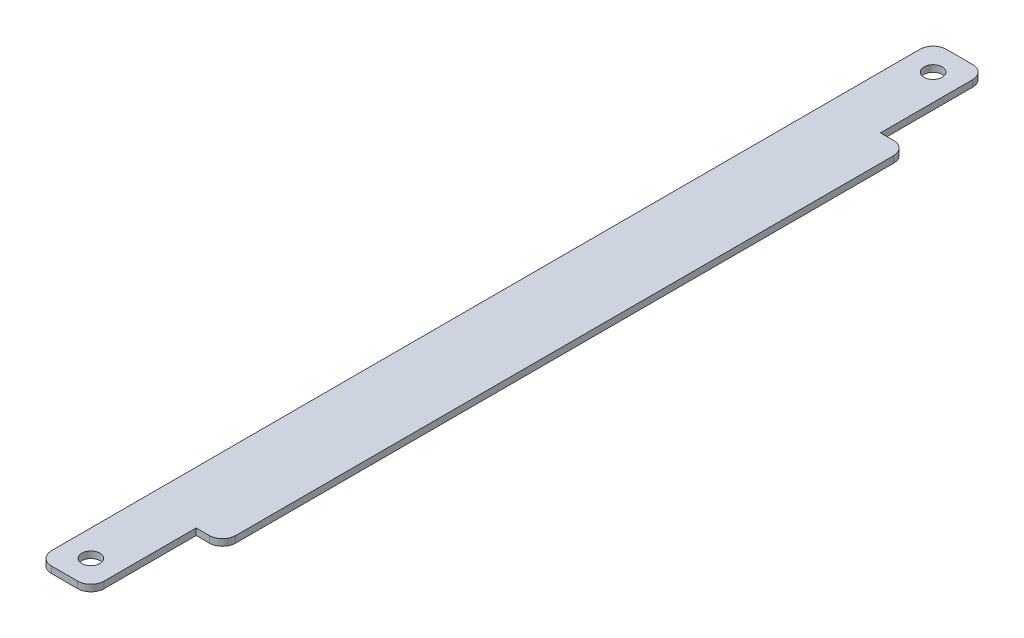
ISO-10303-21;
HEADER;
FILE_DESCRIPTION(('STEP AP214'),'2;1');
FILE_NAME('part.step','',(''),(''),'','','');
FILE_SCHEMA(('AUTOMOTIVE_DESIGN { 1 0 10303 214 1 1 1 1 }'));
ENDSEC;
DATA;
#1=APPLICATION_CONTEXT('core data for automotive mechanical design processes');
#2=APPLICATION_PROTOCOL_DEFINITION('international standard','automotive_design',2000,#1);
#3=PRODUCT_CONTEXT('',#1,'mechanical');
#4=PRODUCT('Part','Part','',(#3));
#5=PRODUCT_RELATED_PRODUCT_CATEGORY('part','',(#4));
#6=PRODUCT_DEFINITION_FORMATION('','',#4);
#7=PRODUCT_DEFINITION_CONTEXT('part definition',#1,'design');
#8=PRODUCT_DEFINITION('design','',#6,#7);
#9=PRODUCT_DEFINITION_SHAPE('','',#8);
#10=(LENGTH_UNIT() NAMED_UNIT(*) SI_UNIT(.MILLI.,.METRE.));
#11=(NAMED_UNIT(*) PLANE_ANGLE_UNIT() SI_UNIT($,.RADIAN.));
#12=(NAMED_UNIT(*) SI_UNIT($,.STERADIAN.) SOLID_ANGLE_UNIT());
#13=UNCERTAINTY_MEASURE_WITH_UNIT(LENGTH_MEASURE(1.E-05),#10,'distance_accuracy_value','');
#14=(GEOMETRIC_REPRESENTATION_CONTEXT(3) GLOBAL_UNCERTAINTY_ASSIGNED_CONTEXT((#13)) GLOBAL_UNIT_ASSIGNED_CONTEXT((#10,
#11,#12)) REPRESENTATION_CONTEXT('',''));
#15=CARTESIAN_POINT('',(0.,0.,0.));
#16=DIRECTION('',(0.,0.,1.));
#17=DIRECTION('',(1.,0.,0.));
#18=AXIS2_PLACEMENT_3D('',#15,#16,#17);
#19=CARTESIAN_POINT('',(15.875,1.5875,-187.325));
#20=DIRECTION('',(0.,1.,0.));
#21=DIRECTION('',(0.,0.,1.));
#22=AXIS2_PLACEMENT_3D('',#19,#20,#21);
#23=PLANE('',#22);
#24=CARTESIAN_POINT('',(6.35,1.5875,-209.55));
#25=DIRECTION('',(0.,1.,0.));
#26=DIRECTION('',(0.,0.,1.));
#27=AXIS2_PLACEMENT_3D('',#24,#25,#26);
#28=CIRCLE('',#27,2.1828125);
#29=CARTESIAN_POINT('',(6.35,1.5875,-207.3671875));
#30=VERTEX_POINT('',#29);
#31=EDGE_CURVE('E174',#30,#30,#28,.T.);
#32=ORIENTED_EDGE('',*,*,#31,.F.);
#33=EDGE_LOOP('',(#32));
#34=FACE_BOUND('',#33,.T.);
#35=DIRECTION('',(-1.,0.,0.));
#36=VECTOR('',#35,1.);
#37=CARTESIAN_POINT('',(12.7,1.5875,-190.5));
#38=LINE('',#37,#36);
#39=CARTESIAN_POINT('',(15.875,1.5875,-190.5));
#40=VERTEX_POINT('',#39);
#41=CARTESIAN_POINT('',(12.7,1.5875,-190.5));
#42=VERTEX_POINT('',#41);
#43=EDGE_CURVE('E197',#40,#42,#38,.T.);
#44=ORIENTED_EDGE('',*,*,#43,.T.);
#45=DIRECTION('',(0.,0.,-1.));
#46=VECTOR('',#45,1.);
#47=CARTESIAN_POINT('',(12.7,1.5875,-212.725));
#48=LINE('',#47,#46);
#49=CARTESIAN_POINT('',(12.7,1.5875,-212.725));
#50=VERTEX_POINT('',#49);
#51=EDGE_CURVE('E115',#42,#50,#48,.T.);
#52=ORIENTED_EDGE('',*,*,#51,.T.);
#53=CARTESIAN_POINT('',(9.525,1.5875,-212.725));
#54=DIRECTION('',(0.,1.,0.));
#55=DIRECTION('',(0.,0.,1.));
#56=AXIS2_PLACEMENT_3D('',#53,#54,#55);
#57=CIRCLE('',#56,3.17500000000001);
#58=CARTESIAN_POINT('',(9.52499999999997,1.5875,-215.9));
#59=VERTEX_POINT('',#58);
#60=EDGE_CURVE('E230',#50,#59,#57,.T.);
#61=ORIENTED_EDGE('',*,*,#60,.T.);
#62=DIRECTION('',(-1.,0.,0.));
#63=VECTOR('',#62,1.);
#64=CARTESIAN_POINT('',(3.17500000000002,1.5875,-215.9));
#65=LINE('',#64,#63);
#66=CARTESIAN_POINT('',(3.17500000000002,1.5875,-215.9));
#67=VERTEX_POINT('',#66);
#68=EDGE_CURVE('E249',#59,#67,#65,.T.);
#69=ORIENTED_EDGE('',*,*,#68,.T.);
#70=CARTESIAN_POINT('',(3.175,1.5875,-212.725));
#71=DIRECTION('',(0.,1.,0.));
#72=DIRECTION('',(0.,0.,1.));
#73=AXIS2_PLACEMENT_3D('',#70,#71,#72);
#74=CIRCLE('',#73,3.17500000000001);
#75=CARTESIAN_POINT('',(0.,1.5875,-212.725));
#76=VERTEX_POINT('',#75);
#77=EDGE_CURVE('E246',#67,#76,#74,.T.);
#78=ORIENTED_EDGE('',*,*,#77,.T.);
#79=DIRECTION('',(0.,0.,1.));
#80=VECTOR('',#79,1.);
#81=CARTESIAN_POINT('',(0.,1.5875,-3.17500000000002));
#82=LINE('',#81,#80);
#83=CARTESIAN_POINT('',(0.,1.5875,-3.17500000000002));
#84=VERTEX_POINT('',#83);
#85=EDGE_CURVE('E248',#76,#84,#82,.T.);
#86=ORIENTED_EDGE('',*,*,#85,.T.);
#87=CARTESIAN_POINT('',(3.175,1.5875,-3.175));
#88=DIRECTION('',(0.,1.,0.));
#89=DIRECTION('',(0.,0.,1.));
#90=AXIS2_PLACEMENT_3D('',#87,#88,#89);
#91=CIRCLE('',#90,3.175);
#92=CARTESIAN_POINT('',(3.175,1.5875,0.));
#93=VERTEX_POINT('',#92);
#94=EDGE_CURVE('E251',#84,#93,#91,.T.);
#95=ORIENTED_EDGE('',*,*,#94,.T.);
#96=DIRECTION('',(1.,0.,0.));
#97=VECTOR('',#96,1.);
#98=CARTESIAN_POINT('',(9.52499999999998,1.5875,0.));
#99=LINE('',#98,#97);
#100=CARTESIAN_POINT('',(9.52499999999998,1.5875,0.));
#101=VERTEX_POINT('',#100);
#102=EDGE_CURVE('E257',#93,#101,#99,.T.);
#103=ORIENTED_EDGE('',*,*,#102,.T.);
#104=CARTESIAN_POINT('',(9.525,1.5875,-3.175));
#105=DIRECTION('',(0.,1.,0.));
#106=DIRECTION('',(0.,0.,1.));
#107=AXIS2_PLACEMENT_3D('',#104,#105,#106);
#108=CIRCLE('',#107,3.175);
#109=CARTESIAN_POINT('',(12.7,1.5875,-3.17500000000002));
#110=VERTEX_POINT('',#109);
#111=EDGE_CURVE('E259',#101,#110,#108,.T.);
#112=ORIENTED_EDGE('',*,*,#111,.T.);
#113=DIRECTION('',(0.,0.,-1.));
#114=VECTOR('',#113,1.);
#115=CARTESIAN_POINT('',(12.7,1.5875,-25.4));
#116=LINE('',#115,#114);
#117=CARTESIAN_POINT('',(12.7,1.5875,-25.4));
#118=VERTEX_POINT('',#117);
#119=EDGE_CURVE('E261',#110,#118,#116,.T.);
#120=ORIENTED_EDGE('',*,*,#119,.T.);
#121=DIRECTION('',(1.,0.,0.));
#122=VECTOR('',#121,1.);
#123=CARTESIAN_POINT('',(15.875,1.5875,-25.4));
#124=LINE('',#123,#122);
#125=CARTESIAN_POINT('',(15.875,1.5875,-25.4));
#126=VERTEX_POINT('',#125);
#127=EDGE_CURVE('E152',#118,#126,#124,.T.);
#128=ORIENTED_EDGE('',*,*,#127,.T.);
#129=CARTESIAN_POINT('',(15.875,1.5875,-28.575));
#130=DIRECTION('',(0.,1.,0.));
#131=DIRECTION('',(0.,0.,1.));
#132=AXIS2_PLACEMENT_3D('',#129,#130,#131);
#133=CIRCLE('',#132,3.175);
#134=CARTESIAN_POINT('',(19.05,1.5875,-28.575));
#135=VERTEX_POINT('',#134);
#136=EDGE_CURVE('E146',#126,#135,#133,.T.);
#137=ORIENTED_EDGE('',*,*,#136,.T.);
#138=DIRECTION('',(0.,0.,-1.));
#139=VECTOR('',#138,1.);
#140=CARTESIAN_POINT('',(19.05,1.5875,-187.325));
#141=LINE('',#140,#139);
#142=CARTESIAN_POINT('',(19.05,1.5875,-187.325));
#143=VERTEX_POINT('',#142);
#144=EDGE_CURVE('E150',#135,#143,#141,.T.);
#145=ORIENTED_EDGE('',*,*,#144,.T.);
#146=CARTESIAN_POINT('',(15.875,1.5875,-187.325));
#147=DIRECTION('',(0.,1.,0.));
#148=DIRECTION('',(0.,0.,1.));
#149=AXIS2_PLACEMENT_3D('',#146,#147,#148);
#150=CIRCLE('',#149,3.175);
#151=EDGE_CURVE('E54',#143,#40,#150,.T.);
#152=ORIENTED_EDGE('',*,*,#151,.T.);
#153=EDGE_LOOP('',(#44,#52,#61,#69,#78,#86,#95,#103,#112,#120,#128,#137,#145,#152));
#154=FACE_BOUND('',#153,.T.);
#155=CARTESIAN_POINT('',(6.35,1.5875,-6.35));
#156=DIRECTION('',(0.,1.,0.));
#157=DIRECTION('',(0.,0.,1.));
#158=AXIS2_PLACEMENT_3D('',#155,#156,#157);
#159=CIRCLE('',#158,2.1828125);
#160=CARTESIAN_POINT('',(6.35,1.5875,-4.1671875));
#161=VERTEX_POINT('',#160);
#162=EDGE_CURVE('E303',#161,#161,#159,.T.);
#163=ORIENTED_EDGE('',*,*,#162,.F.);
#164=EDGE_LOOP('',(#163));
#165=FACE_BOUND('',#164,.T.);
#166=ADVANCED_FACE('F37',(#34,#154,#165),#23,.T.);
#167=CARTESIAN_POINT('',(15.875,0.,-187.325));
#168=DIRECTION('',(0.,1.,0.));
#169=DIRECTION('',(0.,0.,1.));
#170=AXIS2_PLACEMENT_3D('',#167,#168,#169);
#171=PLANE('',#170);
#172=DIRECTION('',(-1.,0.,0.));
#173=VECTOR('',#172,1.);
#174=CARTESIAN_POINT('',(12.7,0.,-190.5));
#175=LINE('',#174,#173);
#176=CARTESIAN_POINT('',(15.875,0.,-190.5));
#177=VERTEX_POINT('',#176);
#178=CARTESIAN_POINT('',(12.7,0.,-190.5));
#179=VERTEX_POINT('',#178);
#180=EDGE_CURVE('E170',#177,#179,#175,.T.);
#181=ORIENTED_EDGE('',*,*,#180,.F.);
#182=CARTESIAN_POINT('',(15.875,0.,-187.325));
#183=DIRECTION('',(0.,1.,0.));
#184=DIRECTION('',(0.,0.,1.));
#185=AXIS2_PLACEMENT_3D('',#182,#183,#184);
#186=CIRCLE('',#185,3.175);
#187=CARTESIAN_POINT('',(19.05,0.,-187.325));
#188=VERTEX_POINT('',#187);
#189=EDGE_CURVE('E107',#188,#177,#186,.T.);
#190=ORIENTED_EDGE('',*,*,#189,.F.);
#191=DIRECTION('',(0.,0.,-1.));
#192=VECTOR('',#191,1.);
#193=CARTESIAN_POINT('',(19.05,0.,-187.325));
#194=LINE('',#193,#192);
#195=CARTESIAN_POINT('',(19.05,0.,-28.575));
#196=VERTEX_POINT('',#195);
#197=EDGE_CURVE('E101',#196,#188,#194,.T.);
#198=ORIENTED_EDGE('',*,*,#197,.F.);
#199=CARTESIAN_POINT('',(15.875,0.,-28.575));
#200=DIRECTION('',(0.,1.,0.));
#201=DIRECTION('',(0.,0.,1.));
#202=AXIS2_PLACEMENT_3D('',#199,#200,#201);
#203=CIRCLE('',#202,3.175);
#204=CARTESIAN_POINT('',(15.875,0.,-25.4));
#205=VERTEX_POINT('',#204);
#206=EDGE_CURVE('E160',#205,#196,#203,.T.);
#207=ORIENTED_EDGE('',*,*,#206,.F.);
#208=DIRECTION('',(1.,0.,0.));
#209=VECTOR('',#208,1.);
#210=CARTESIAN_POINT('',(15.875,0.,-25.4));
#211=LINE('',#210,#209);
#212=CARTESIAN_POINT('',(12.7,0.,-25.4));
#213=VERTEX_POINT('',#212);
#214=EDGE_CURVE('E192',#213,#205,#211,.T.);
#215=ORIENTED_EDGE('',*,*,#214,.F.);
#216=DIRECTION('',(0.,0.,-1.));
#217=VECTOR('',#216,1.);
#218=CARTESIAN_POINT('',(12.7,0.,-25.4));
#219=LINE('',#218,#217);
#220=CARTESIAN_POINT('',(12.7,0.,-3.17500000000002));
#221=VERTEX_POINT('',#220);
#222=EDGE_CURVE('E190',#221,#213,#219,.T.);
#223=ORIENTED_EDGE('',*,*,#222,.F.);
#224=CARTESIAN_POINT('',(9.525,0.,-3.175));
#225=DIRECTION('',(0.,1.,0.));
#226=DIRECTION('',(0.,0.,1.));
#227=AXIS2_PLACEMENT_3D('',#224,#225,#226);
#228=CIRCLE('',#227,3.175);
#229=CARTESIAN_POINT('',(9.52499999999998,0.,0.));
#230=VERTEX_POINT('',#229);
#231=EDGE_CURVE('E188',#230,#221,#228,.T.);
#232=ORIENTED_EDGE('',*,*,#231,.F.);
#233=DIRECTION('',(1.,0.,0.));
#234=VECTOR('',#233,1.);
#235=CARTESIAN_POINT('',(9.52499999999998,0.,0.));
#236=LINE('',#235,#234);
#237=CARTESIAN_POINT('',(3.175,0.,0.));
#238=VERTEX_POINT('',#237);
#239=EDGE_CURVE('E186',#238,#230,#236,.T.);
#240=ORIENTED_EDGE('',*,*,#239,.F.);
#241=CARTESIAN_POINT('',(3.175,0.,-3.175));
#242=DIRECTION('',(0.,1.,0.));
#243=DIRECTION('',(0.,0.,1.));
#244=AXIS2_PLACEMENT_3D('',#241,#242,#243);
#245=CIRCLE('',#244,3.175);
#246=CARTESIAN_POINT('',(0.,0.,-3.17500000000002));
#247=VERTEX_POINT('',#246);
#248=EDGE_CURVE('E184',#247,#238,#245,.T.);
#249=ORIENTED_EDGE('',*,*,#248,.F.);
#250=DIRECTION('',(0.,0.,1.));
#251=VECTOR('',#250,1.);
#252=CARTESIAN_POINT('',(0.,0.,-3.17500000000002));
#253=LINE('',#252,#251);
#254=CARTESIAN_POINT('',(0.,0.,-212.725));
#255=VERTEX_POINT('',#254);
#256=EDGE_CURVE('E182',#255,#247,#253,.T.);
#257=ORIENTED_EDGE('',*,*,#256,.F.);
#258=CARTESIAN_POINT('',(3.175,0.,-212.725));
#259=DIRECTION('',(0.,1.,0.));
#260=DIRECTION('',(0.,0.,1.));
#261=AXIS2_PLACEMENT_3D('',#258,#259,#260);
#262=CIRCLE('',#261,3.17500000000001);
#263=CARTESIAN_POINT('',(3.17500000000002,0.,-215.9));
#264=VERTEX_POINT('',#263);
#265=EDGE_CURVE('E180',#264,#255,#262,.T.);
#266=ORIENTED_EDGE('',*,*,#265,.F.);
#267=DIRECTION('',(-1.,0.,0.));
#268=VECTOR('',#267,1.);
#269=CARTESIAN_POINT('',(3.17500000000002,0.,-215.9));
#270=LINE('',#269,#268);
#271=CARTESIAN_POINT('',(9.52499999999997,0.,-215.9));
#272=VERTEX_POINT('',#271);
#273=EDGE_CURVE('E178',#272,#264,#270,.T.);
#274=ORIENTED_EDGE('',*,*,#273,.F.);
#275=CARTESIAN_POINT('',(9.525,0.,-212.725));
#276=DIRECTION('',(0.,1.,0.));
#277=DIRECTION('',(0.,0.,1.));
#278=AXIS2_PLACEMENT_3D('',#275,#276,#277);
#279=CIRCLE('',#278,3.17500000000001);
#280=CARTESIAN_POINT('',(12.7,0.,-212.725));
#281=VERTEX_POINT('',#280);
#282=EDGE_CURVE('E176',#281,#272,#279,.T.);
#283=ORIENTED_EDGE('',*,*,#282,.F.);
#284=DIRECTION('',(0.,0.,-1.));
#285=VECTOR('',#284,1.);
#286=CARTESIAN_POINT('',(12.7,0.,-212.725));
#287=LINE('',#286,#285);
#288=EDGE_CURVE('E173',#179,#281,#287,.T.);
#289=ORIENTED_EDGE('',*,*,#288,.F.);
#290=EDGE_LOOP('',(#181,#190,#198,#207,#215,#223,#232,#240,#249,#257,#266,#274,#283,#289));
#291=FACE_BOUND('',#290,.T.);
#292=CARTESIAN_POINT('',(6.35,0.,-209.55));
#293=DIRECTION('',(0.,1.,0.));
#294=DIRECTION('',(0.,0.,1.));
#295=AXIS2_PLACEMENT_3D('',#292,#293,#294);
#296=CIRCLE('',#295,2.1828125);
#297=CARTESIAN_POINT('',(6.35,0.,-207.3671875));
#298=VERTEX_POINT('',#297);
#299=EDGE_CURVE('E309',#298,#298,#296,.T.);
#300=ORIENTED_EDGE('',*,*,#299,.T.);
#301=EDGE_LOOP('',(#300));
#302=FACE_BOUND('',#301,.T.);
#303=CARTESIAN_POINT('',(6.35,0.,-6.35));
#304=DIRECTION('',(0.,1.,0.));
#305=DIRECTION('',(0.,0.,1.));
#306=AXIS2_PLACEMENT_3D('',#303,#304,#305);
#307=CIRCLE('',#306,2.1828125);
#308=CARTESIAN_POINT('',(6.35,0.,-4.1671875));
#309=VERTEX_POINT('',#308);
#310=EDGE_CURVE('E306',#309,#309,#307,.T.);
#311=ORIENTED_EDGE('',*,*,#310,.T.);
#312=EDGE_LOOP('',(#311));
#313=FACE_BOUND('',#312,.T.);
#314=ADVANCED_FACE('F234',(#291,#302,#313),#171,.F.);
#315=CARTESIAN_POINT('',(12.7,1.5875,-190.5));
#316=DIRECTION('',(0.,0.,1.));
#317=DIRECTION('',(1.,0.,0.));
#318=AXIS2_PLACEMENT_3D('',#315,#316,#317);
#319=PLANE('',#318);
#320=ORIENTED_EDGE('',*,*,#180,.T.);
#321=DIRECTION('',(0.,-1.,0.));
#322=VECTOR('',#321,1.);
#323=CARTESIAN_POINT('',(12.7,1.5875,-190.5));
#324=LINE('',#323,#322);
#325=EDGE_CURVE('E11',#42,#179,#324,.T.);
#326=ORIENTED_EDGE('',*,*,#325,.F.);
#327=ORIENTED_EDGE('',*,*,#43,.F.);
#328=DIRECTION('',(0.,-1.,0.));
#329=VECTOR('',#328,1.);
#330=CARTESIAN_POINT('',(15.875,1.5875,-190.5));
#331=LINE('',#330,#329);
#332=EDGE_CURVE('E166',#40,#177,#331,.T.);
#333=ORIENTED_EDGE('',*,*,#332,.T.);
#334=EDGE_LOOP('',(#320,#326,#327,#333));
#335=FACE_BOUND('',#334,.T.);
#336=ADVANCED_FACE('F39',(#335),#319,.F.);
#337=CARTESIAN_POINT('',(12.7,1.5875,-212.725));
#338=DIRECTION('',(-1.,0.,0.));
#339=DIRECTION('',(0.,0.,1.));
#340=AXIS2_PLACEMENT_3D('',#337,#338,#339);
#341=PLANE('',#340);
#342=ORIENTED_EDGE('',*,*,#288,.T.);
#343=DIRECTION('',(0.,-1.,0.));
#344=VECTOR('',#343,1.);
#345=CARTESIAN_POINT('',(12.7,1.5875,-212.725));
#346=LINE('',#345,#344);
#347=EDGE_CURVE('E46',#50,#281,#346,.T.);
#348=ORIENTED_EDGE('',*,*,#347,.F.);
#349=ORIENTED_EDGE('',*,*,#51,.F.);
#350=ORIENTED_EDGE('',*,*,#325,.T.);
#351=EDGE_LOOP('',(#342,#348,#349,#350));
#352=FACE_BOUND('',#351,.T.);
#353=ADVANCED_FACE('F422',(#352),#341,.F.);
#354=CARTESIAN_POINT('',(9.525,1.5875,-212.725));
#355=DIRECTION('',(0.,-1.,0.));
#356=DIRECTION('',(0.,0.,-1.));
#357=AXIS2_PLACEMENT_3D('',#354,#355,#356);
#358=CYLINDRICAL_SURFACE('',#357,3.17500000000001);
#359=ORIENTED_EDGE('',*,*,#282,.T.);
#360=DIRECTION('',(0.,-1.,0.));
#361=VECTOR('',#360,1.);
#362=CARTESIAN_POINT('',(9.52499999999997,1.5875,-215.9));
#363=LINE('',#362,#361);
#364=EDGE_CURVE('E222',#59,#272,#363,.T.);
#365=ORIENTED_EDGE('',*,*,#364,.F.);
#366=ORIENTED_EDGE('',*,*,#60,.F.);
#367=ORIENTED_EDGE('',*,*,#347,.T.);
#368=EDGE_LOOP('',(#359,#365,#366,#367));
#369=FACE_BOUND('',#368,.T.);
#370=ADVANCED_FACE('F228',(#369),#358,.T.);
#371=CARTESIAN_POINT('',(3.17500000000002,1.5875,-215.9));
#372=DIRECTION('',(0.,0.,1.));
#373=DIRECTION('',(1.,0.,0.));
#374=AXIS2_PLACEMENT_3D('',#371,#372,#373);
#375=PLANE('',#374);
#376=ORIENTED_EDGE('',*,*,#273,.T.);
#377=DIRECTION('',(0.,-1.,0.));
#378=VECTOR('',#377,1.);
#379=CARTESIAN_POINT('',(3.17500000000002,1.5875,-215.9));
#380=LINE('',#379,#378);
#381=EDGE_CURVE('E219',#67,#264,#380,.T.);
#382=ORIENTED_EDGE('',*,*,#381,.F.);
#383=ORIENTED_EDGE('',*,*,#68,.F.);
#384=ORIENTED_EDGE('',*,*,#364,.T.);
#385=EDGE_LOOP('',(#376,#382,#383,#384));
#386=FACE_BOUND('',#385,.T.);
#387=ADVANCED_FACE('F240',(#386),#375,.F.);
#388=CARTESIAN_POINT('',(3.175,1.5875,-212.725));
#389=DIRECTION('',(0.,-1.,0.));
#390=DIRECTION('',(0.,0.,-1.));
#391=AXIS2_PLACEMENT_3D('',#388,#389,#390);
#392=CYLINDRICAL_SURFACE('',#391,3.17500000000001);
#393=ORIENTED_EDGE('',*,*,#265,.T.);
#394=DIRECTION('',(0.,-1.,0.));
#395=VECTOR('',#394,1.);
#396=CARTESIAN_POINT('',(0.,1.5875,-212.725));
#397=LINE('',#396,#395);
#398=EDGE_CURVE('E216',#76,#255,#397,.T.);
#399=ORIENTED_EDGE('',*,*,#398,.F.);
#400=ORIENTED_EDGE('',*,*,#77,.F.);
#401=ORIENTED_EDGE('',*,*,#381,.T.);
#402=EDGE_LOOP('',(#393,#399,#400,#401));
#403=FACE_BOUND('',#402,.T.);
#404=ADVANCED_FACE('F244',(#403),#392,.T.);
#405=CARTESIAN_POINT('',(0.,1.5875,-3.17500000000002));
#406=DIRECTION('',(1.,0.,0.));
#407=DIRECTION('',(0.,0.,-1.));
#408=AXIS2_PLACEMENT_3D('',#405,#406,#407);
#409=PLANE('',#408);
#410=ORIENTED_EDGE('',*,*,#256,.T.);
#411=DIRECTION('',(0.,-1.,0.));
#412=VECTOR('',#411,1.);
#413=CARTESIAN_POINT('',(0.,1.5875,-3.17500000000002));
#414=LINE('',#413,#412);
#415=EDGE_CURVE('E213',#84,#247,#414,.T.);
#416=ORIENTED_EDGE('',*,*,#415,.F.);
#417=ORIENTED_EDGE('',*,*,#85,.F.);
#418=ORIENTED_EDGE('',*,*,#398,.T.);
#419=EDGE_LOOP('',(#410,#416,#417,#418));
#420=FACE_BOUND('',#419,.T.);
#421=ADVANCED_FACE('F387',(#420),#409,.F.);
#422=CARTESIAN_POINT('',(3.175,1.5875,-3.175));
#423=DIRECTION('',(0.,-1.,0.));
#424=DIRECTION('',(0.,0.,-1.));
#425=AXIS2_PLACEMENT_3D('',#422,#423,#424);
#426=CYLINDRICAL_SURFACE('',#425,3.175);
#427=ORIENTED_EDGE('',*,*,#248,.T.);
#428=DIRECTION('',(0.,-1.,0.));
#429=VECTOR('',#428,1.);
#430=CARTESIAN_POINT('',(3.175,1.5875,0.));
#431=LINE('',#430,#429);
#432=EDGE_CURVE('E210',#93,#238,#431,.T.);
#433=ORIENTED_EDGE('',*,*,#432,.F.);
#434=ORIENTED_EDGE('',*,*,#94,.F.);
#435=ORIENTED_EDGE('',*,*,#415,.T.);
#436=EDGE_LOOP('',(#427,#433,#434,#435));
#437=FACE_BOUND('',#436,.T.);
#438=ADVANCED_FACE('F377',(#437),#426,.T.);
#439=CARTESIAN_POINT('',(9.52499999999998,1.5875,0.));
#440=DIRECTION('',(0.,0.,-1.));
#441=DIRECTION('',(-1.,0.,0.));
#442=AXIS2_PLACEMENT_3D('',#439,#440,#441);
#443=PLANE('',#442);
#444=ORIENTED_EDGE('',*,*,#239,.T.);
#445=DIRECTION('',(0.,-1.,0.));
#446=VECTOR('',#445,1.);
#447=CARTESIAN_POINT('',(9.52499999999998,1.5875,0.));
#448=LINE('',#447,#446);
#449=EDGE_CURVE('E207',#101,#230,#448,.T.);
#450=ORIENTED_EDGE('',*,*,#449,.F.);
#451=ORIENTED_EDGE('',*,*,#102,.F.);
#452=ORIENTED_EDGE('',*,*,#432,.T.);
#453=EDGE_LOOP('',(#444,#450,#451,#452));
#454=FACE_BOUND('',#453,.T.);
#455=ADVANCED_FACE('F367',(#454),#443,.F.);
#456=CARTESIAN_POINT('',(9.525,1.5875,-3.175));
#457=DIRECTION('',(0.,-1.,0.));
#458=DIRECTION('',(0.,0.,-1.));
#459=AXIS2_PLACEMENT_3D('',#456,#457,#458);
#460=CYLINDRICAL_SURFACE('',#459,3.175);
#461=ORIENTED_EDGE('',*,*,#231,.T.);
#462=DIRECTION('',(0.,-1.,0.));
#463=VECTOR('',#462,1.);
#464=CARTESIAN_POINT('',(12.7,1.5875,-3.17500000000002));
#465=LINE('',#464,#463);
#466=EDGE_CURVE('E204',#110,#221,#465,.T.);
#467=ORIENTED_EDGE('',*,*,#466,.F.);
#468=ORIENTED_EDGE('',*,*,#111,.F.);
#469=ORIENTED_EDGE('',*,*,#449,.T.);
#470=EDGE_LOOP('',(#461,#467,#468,#469));
#471=FACE_BOUND('',#470,.T.);
#472=ADVANCED_FACE('F358',(#471),#460,.T.);
#473=CARTESIAN_POINT('',(12.7,1.5875,-25.4));
#474=DIRECTION('',(-1.,0.,0.));
#475=DIRECTION('',(0.,0.,1.));
#476=AXIS2_PLACEMENT_3D('',#473,#474,#475);
#477=PLANE('',#476);
#478=ORIENTED_EDGE('',*,*,#222,.T.);
#479=DIRECTION('',(0.,-1.,0.));
#480=VECTOR('',#479,1.);
#481=CARTESIAN_POINT('',(12.7,1.5875,-25.4));
#482=LINE('',#481,#480);
#483=EDGE_CURVE('E201',#118,#213,#482,.T.);
#484=ORIENTED_EDGE('',*,*,#483,.F.);
#485=ORIENTED_EDGE('',*,*,#119,.F.);
#486=ORIENTED_EDGE('',*,*,#466,.T.);
#487=EDGE_LOOP('',(#478,#484,#485,#486));
#488=FACE_BOUND('',#487,.T.);
#489=ADVANCED_FACE('F267',(#488),#477,.F.);
#490=CARTESIAN_POINT('',(15.875,1.5875,-25.4));
#491=DIRECTION('',(0.,0.,-1.));
#492=DIRECTION('',(-1.,0.,0.));
#493=AXIS2_PLACEMENT_3D('',#490,#491,#492);
#494=PLANE('',#493);
#495=ORIENTED_EDGE('',*,*,#214,.T.);
#496=DIRECTION('',(0.,-1.,0.));
#497=VECTOR('',#496,1.);
#498=CARTESIAN_POINT('',(15.875,1.5875,-25.4));
#499=LINE('',#498,#497);
#500=EDGE_CURVE('E161',#126,#205,#499,.T.);
#501=ORIENTED_EDGE('',*,*,#500,.F.);
#502=ORIENTED_EDGE('',*,*,#127,.F.);
#503=ORIENTED_EDGE('',*,*,#483,.T.);
#504=EDGE_LOOP('',(#495,#501,#502,#503));
#505=FACE_BOUND('',#504,.T.);
#506=ADVANCED_FACE('F271',(#505),#494,.F.);
#507=CARTESIAN_POINT('',(15.875,1.5875,-28.575));
#508=DIRECTION('',(0.,-1.,0.));
#509=DIRECTION('',(0.,0.,-1.));
#510=AXIS2_PLACEMENT_3D('',#507,#508,#509);
#511=CYLINDRICAL_SURFACE('',#510,3.175);
#512=ORIENTED_EDGE('',*,*,#206,.T.);
#513=DIRECTION('',(0.,-1.,0.));
#514=VECTOR('',#513,1.);
#515=CARTESIAN_POINT('',(19.05,1.5875,-28.575));
#516=LINE('',#515,#514);
#517=EDGE_CURVE('E157',#135,#196,#516,.T.);
#518=ORIENTED_EDGE('',*,*,#517,.F.);
#519=ORIENTED_EDGE('',*,*,#136,.F.);
#520=ORIENTED_EDGE('',*,*,#500,.T.);
#521=EDGE_LOOP('',(#512,#518,#519,#520));
#522=FACE_BOUND('',#521,.T.);
#523=ADVANCED_FACE('F158',(#522),#511,.T.);
#524=CARTESIAN_POINT('',(19.05,1.5875,-187.325));
#525=DIRECTION('',(-1.,0.,0.));
#526=DIRECTION('',(0.,0.,1.));
#527=AXIS2_PLACEMENT_3D('',#524,#525,#526);
#528=PLANE('',#527);
#529=ORIENTED_EDGE('',*,*,#197,.T.);
#530=DIRECTION('',(0.,-1.,0.));
#531=VECTOR('',#530,1.);
#532=CARTESIAN_POINT('',(19.05,1.5875,-187.325));
#533=LINE('',#532,#531);
#534=EDGE_CURVE('E162',#143,#188,#533,.T.);
#535=ORIENTED_EDGE('',*,*,#534,.F.);
#536=ORIENTED_EDGE('',*,*,#144,.F.);
#537=ORIENTED_EDGE('',*,*,#517,.T.);
#538=EDGE_LOOP('',(#529,#535,#536,#537));
#539=FACE_BOUND('',#538,.T.);
#540=ADVANCED_FACE('F164',(#539),#528,.F.);
#541=CARTESIAN_POINT('',(15.875,1.5875,-187.325));
#542=DIRECTION('',(0.,-1.,0.));
#543=DIRECTION('',(0.,0.,-1.));
#544=AXIS2_PLACEMENT_3D('',#541,#542,#543);
#545=CYLINDRICAL_SURFACE('',#544,3.175);
#546=ORIENTED_EDGE('',*,*,#189,.T.);
#547=ORIENTED_EDGE('',*,*,#332,.F.);
#548=ORIENTED_EDGE('',*,*,#151,.F.);
#549=ORIENTED_EDGE('',*,*,#534,.T.);
#550=EDGE_LOOP('',(#546,#547,#548,#549));
#551=FACE_BOUND('',#550,.T.);
#552=ADVANCED_FACE('F275',(#551),#545,.T.);
#553=CARTESIAN_POINT('',(6.35,1.5875,-209.55));
#554=DIRECTION('',(0.,-1.,0.));
#555=DIRECTION('',(0.,0.,-1.));
#556=AXIS2_PLACEMENT_3D('',#553,#554,#555);
#557=CYLINDRICAL_SURFACE('',#556,2.1828125);
#558=ORIENTED_EDGE('',*,*,#31,.T.);
#559=EDGE_LOOP('',(#558));
#560=FACE_BOUND('',#559,.T.);
#561=ORIENTED_EDGE('',*,*,#299,.F.);
#562=EDGE_LOOP('',(#561));
#563=FACE_BOUND('',#562,.T.);
#564=ADVANCED_FACE('F277',(#560,#563),#557,.F.);
#565=CARTESIAN_POINT('',(6.35,1.5875,-6.35));
#566=DIRECTION('',(0.,-1.,0.));
#567=DIRECTION('',(0.,0.,-1.));
#568=AXIS2_PLACEMENT_3D('',#565,#566,#567);
#569=CYLINDRICAL_SURFACE('',#568,2.1828125);
#570=ORIENTED_EDGE('',*,*,#162,.T.);
#571=EDGE_LOOP('',(#570));
#572=FACE_BOUND('',#571,.T.);
#573=ORIENTED_EDGE('',*,*,#310,.F.);
#574=EDGE_LOOP('',(#573));
#575=FACE_BOUND('',#574,.T.);
#576=ADVANCED_FACE('F283',(#572,#575),#569,.F.);
#577=CLOSED_SHELL('',(#166,#314,#336,#353,#370,#387,#404,#421,#438,#455,#472,#489,#506,#523,
#540,#552,#564,#576));
#578=MANIFOLD_SOLID_BREP('B2',#577);
#579=ADVANCED_BREP_SHAPE_REPRESENTATION('',(#18,#578),#14);
#580=SHAPE_DEFINITION_REPRESENTATION(#9,#579);
ENDSEC;
END-ISO-10303-21;
